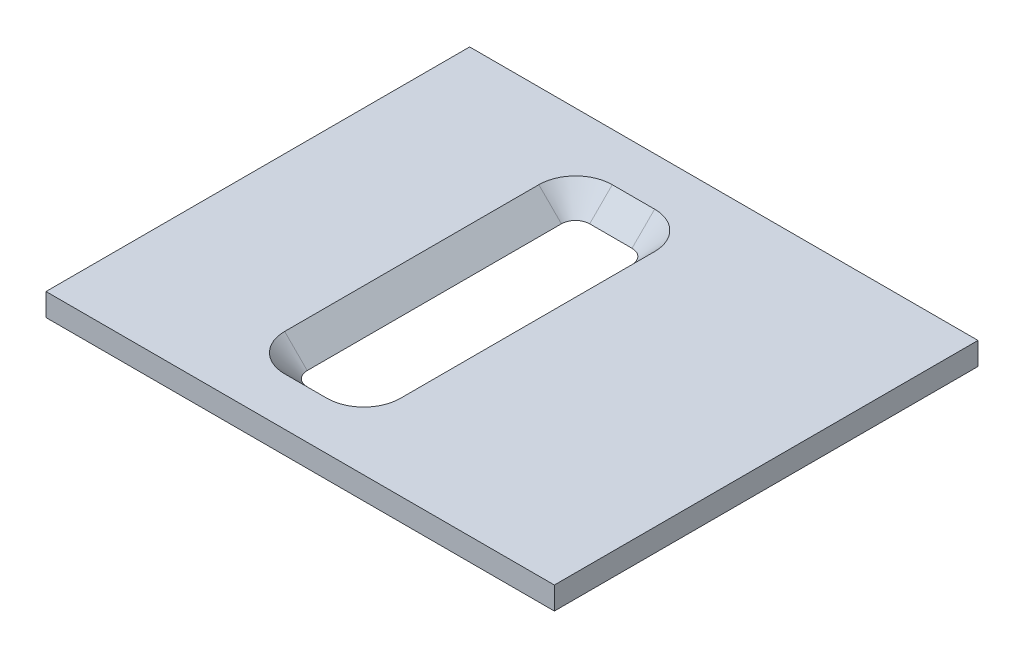
ISO-10303-21;
HEADER;
FILE_DESCRIPTION(('STEP AP214'),'2;1');
FILE_NAME('part.step','',(''),(''),'','','');
FILE_SCHEMA(('AUTOMOTIVE_DESIGN { 1 0 10303 214 1 1 1 1 }'));
ENDSEC;
DATA;
#1=APPLICATION_CONTEXT('core data for automotive mechanical design processes');
#2=APPLICATION_PROTOCOL_DEFINITION('international standard','automotive_design',2000,#1);
#3=PRODUCT_CONTEXT('',#1,'mechanical');
#4=PRODUCT('Part','Part','',(#3));
#5=PRODUCT_RELATED_PRODUCT_CATEGORY('part','',(#4));
#6=PRODUCT_DEFINITION_FORMATION('','',#4);
#7=PRODUCT_DEFINITION_CONTEXT('part definition',#1,'design');
#8=PRODUCT_DEFINITION('design','',#6,#7);
#9=PRODUCT_DEFINITION_SHAPE('','',#8);
#10=(LENGTH_UNIT() NAMED_UNIT(*) SI_UNIT(.MILLI.,.METRE.));
#11=(NAMED_UNIT(*) PLANE_ANGLE_UNIT() SI_UNIT($,.RADIAN.));
#12=(NAMED_UNIT(*) SI_UNIT($,.STERADIAN.) SOLID_ANGLE_UNIT());
#13=UNCERTAINTY_MEASURE_WITH_UNIT(LENGTH_MEASURE(1.E-05),#10,'distance_accuracy_value','');
#14=(GEOMETRIC_REPRESENTATION_CONTEXT(3) GLOBAL_UNCERTAINTY_ASSIGNED_CONTEXT((#13)) GLOBAL_UNIT_ASSIGNED_CONTEXT((#10,
#11,#12)) REPRESENTATION_CONTEXT('',''));
#15=CARTESIAN_POINT('',(0.,0.,0.));
#16=DIRECTION('',(0.,0.,1.));
#17=DIRECTION('',(1.,0.,0.));
#18=AXIS2_PLACEMENT_3D('',#15,#16,#17);
#19=CARTESIAN_POINT('',(0.,1.6002,0.));
#20=DIRECTION('',(0.,1.,0.));
#21=DIRECTION('',(0.,0.,1.));
#22=AXIS2_PLACEMENT_3D('',#19,#20,#21);
#23=PLANE('',#22);
#24=DIRECTION('',(0.,0.,-1.));
#25=VECTOR('',#24,1.);
#26=CARTESIAN_POINT('',(21.,1.6002,-15.));
#27=LINE('',#26,#25);
#28=CARTESIAN_POINT('',(21.,1.6002,15.));
#29=VERTEX_POINT('',#28);
#30=CARTESIAN_POINT('',(21.,1.6002,-15.));
#31=VERTEX_POINT('',#30);
#32=EDGE_CURVE('E187',#29,#31,#27,.T.);
#33=ORIENTED_EDGE('',*,*,#32,.T.);
#34=DIRECTION('',(-1.,0.,0.));
#35=VECTOR('',#34,1.);
#36=CARTESIAN_POINT('',(-15.,1.6002,-15.));
#37=LINE('',#36,#35);
#38=CARTESIAN_POINT('',(-15.,1.6002,-15.));
#39=VERTEX_POINT('',#38);
#40=EDGE_CURVE('E190',#31,#39,#37,.T.);
#41=ORIENTED_EDGE('',*,*,#40,.T.);
#42=DIRECTION('',(0.,0.,1.));
#43=VECTOR('',#42,1.);
#44=CARTESIAN_POINT('',(-15.,1.6002,-15.));
#45=LINE('',#44,#43);
#46=CARTESIAN_POINT('',(-15.,1.6002,15.));
#47=VERTEX_POINT('',#46);
#48=EDGE_CURVE('E193',#39,#47,#45,.T.);
#49=ORIENTED_EDGE('',*,*,#48,.T.);
#50=DIRECTION('',(1.,0.,0.));
#51=VECTOR('',#50,1.);
#52=CARTESIAN_POINT('',(-15.,1.6002,15.));
#53=LINE('',#52,#51);
#54=EDGE_CURVE('E195',#47,#29,#53,.T.);
#55=ORIENTED_EDGE('',*,*,#54,.T.);
#56=EDGE_LOOP('',(#33,#41,#49,#55));
#57=FACE_BOUND('',#56,.T.);
#58=DIRECTION('',(0.,0.,1.));
#59=VECTOR('',#58,1.);
#60=CARTESIAN_POINT('',(4.10020000000001,1.6002,9.));
#61=LINE('',#60,#59);
#62=CARTESIAN_POINT('',(4.10020000000001,1.6002,9.));
#63=VERTEX_POINT('',#62);
#64=CARTESIAN_POINT('',(4.10020000000001,1.6002,-9.));
#65=VERTEX_POINT('',#64);
#66=EDGE_CURVE('E161',#63,#65,#61,.F.);
#67=ORIENTED_EDGE('',*,*,#66,.F.);
#68=CARTESIAN_POINT('',(1.5,1.6002,9.));
#69=DIRECTION('',(0.,1.,0.));
#70=DIRECTION('',(0.,0.,1.));
#71=AXIS2_PLACEMENT_3D('',#68,#69,#70);
#72=CIRCLE('',#71,2.60020000000001);
#73=CARTESIAN_POINT('',(1.5,1.6002,11.6002));
#74=VERTEX_POINT('',#73);
#75=EDGE_CURVE('E138',#74,#63,#72,.T.);
#76=ORIENTED_EDGE('',*,*,#75,.F.);
#77=DIRECTION('',(-1.,0.,0.));
#78=VECTOR('',#77,1.);
#79=CARTESIAN_POINT('',(1.5,1.6002,11.6002));
#80=LINE('',#79,#78);
#81=CARTESIAN_POINT('',(-1.5,1.6002,11.6002));
#82=VERTEX_POINT('',#81);
#83=EDGE_CURVE('E173',#82,#74,#80,.F.);
#84=ORIENTED_EDGE('',*,*,#83,.F.);
#85=CARTESIAN_POINT('',(-1.5,1.6002,9.));
#86=DIRECTION('',(0.,1.,0.));
#87=DIRECTION('',(0.,0.,1.));
#88=AXIS2_PLACEMENT_3D('',#85,#86,#87);
#89=CIRCLE('',#88,2.60020000000001);
#90=CARTESIAN_POINT('',(-4.10020000000001,1.6002,9.));
#91=VERTEX_POINT('',#90);
#92=EDGE_CURVE('E171',#91,#82,#89,.T.);
#93=ORIENTED_EDGE('',*,*,#92,.F.);
#94=DIRECTION('',(0.,0.,-1.));
#95=VECTOR('',#94,1.);
#96=CARTESIAN_POINT('',(-4.10020000000001,1.6002,9.));
#97=LINE('',#96,#95);
#98=CARTESIAN_POINT('',(-4.10020000000001,1.6002,-9.));
#99=VERTEX_POINT('',#98);
#100=EDGE_CURVE('E169',#99,#91,#97,.F.);
#101=ORIENTED_EDGE('',*,*,#100,.F.);
#102=CARTESIAN_POINT('',(-1.5,1.6002,-9.));
#103=DIRECTION('',(0.,1.,0.));
#104=DIRECTION('',(0.,0.,1.));
#105=AXIS2_PLACEMENT_3D('',#102,#103,#104);
#106=CIRCLE('',#105,2.60020000000001);
#107=CARTESIAN_POINT('',(-1.5,1.6002,-11.6002));
#108=VERTEX_POINT('',#107);
#109=EDGE_CURVE('E167',#108,#99,#106,.T.);
#110=ORIENTED_EDGE('',*,*,#109,.F.);
#111=DIRECTION('',(1.,0.,0.));
#112=VECTOR('',#111,1.);
#113=CARTESIAN_POINT('',(1.5,1.6002,-11.6002));
#114=LINE('',#113,#112);
#115=CARTESIAN_POINT('',(1.5,1.6002,-11.6002));
#116=VERTEX_POINT('',#115);
#117=EDGE_CURVE('E165',#116,#108,#114,.F.);
#118=ORIENTED_EDGE('',*,*,#117,.F.);
#119=CARTESIAN_POINT('',(1.5,1.6002,-9.));
#120=DIRECTION('',(0.,1.,0.));
#121=DIRECTION('',(0.,0.,1.));
#122=AXIS2_PLACEMENT_3D('',#119,#120,#121);
#123=CIRCLE('',#122,2.60020000000001);
#124=EDGE_CURVE('E163',#65,#116,#123,.T.);
#125=ORIENTED_EDGE('',*,*,#124,.F.);
#126=EDGE_LOOP('',(#67,#76,#84,#93,#101,#110,#118,#125));
#127=FACE_BOUND('',#126,.T.);
#128=ADVANCED_FACE('F34',(#57,#127),#23,.T.);
#129=CARTESIAN_POINT('',(0.,0.,0.));
#130=DIRECTION('',(0.,1.,0.));
#131=DIRECTION('',(0.,0.,1.));
#132=AXIS2_PLACEMENT_3D('',#129,#130,#131);
#133=PLANE('',#132);
#134=DIRECTION('',(0.,0.,-1.));
#135=VECTOR('',#134,1.);
#136=CARTESIAN_POINT('',(21.,0.,-15.));
#137=LINE('',#136,#135);
#138=CARTESIAN_POINT('',(21.,0.,15.));
#139=VERTEX_POINT('',#138);
#140=CARTESIAN_POINT('',(21.,0.,-15.));
#141=VERTEX_POINT('',#140);
#142=EDGE_CURVE('E139',#139,#141,#137,.T.);
#143=ORIENTED_EDGE('',*,*,#142,.F.);
#144=DIRECTION('',(1.,0.,0.));
#145=VECTOR('',#144,1.);
#146=CARTESIAN_POINT('',(-15.,0.,15.));
#147=LINE('',#146,#145);
#148=CARTESIAN_POINT('',(-15.,0.,15.));
#149=VERTEX_POINT('',#148);
#150=EDGE_CURVE('E191',#149,#139,#147,.T.);
#151=ORIENTED_EDGE('',*,*,#150,.F.);
#152=DIRECTION('',(0.,0.,1.));
#153=VECTOR('',#152,1.);
#154=CARTESIAN_POINT('',(-15.,0.,-15.));
#155=LINE('',#154,#153);
#156=CARTESIAN_POINT('',(-15.,0.,-15.));
#157=VERTEX_POINT('',#156);
#158=EDGE_CURVE('E202',#157,#149,#155,.T.);
#159=ORIENTED_EDGE('',*,*,#158,.F.);
#160=DIRECTION('',(-1.,0.,0.));
#161=VECTOR('',#160,1.);
#162=CARTESIAN_POINT('',(-15.,0.,-15.));
#163=LINE('',#162,#161);
#164=EDGE_CURVE('E200',#141,#157,#163,.T.);
#165=ORIENTED_EDGE('',*,*,#164,.F.);
#166=EDGE_LOOP('',(#143,#151,#159,#165));
#167=FACE_BOUND('',#166,.T.);
#168=CARTESIAN_POINT('',(1.5,0.,9.));
#169=DIRECTION('',(0.,1.,0.));
#170=DIRECTION('',(0.,0.,1.));
#171=AXIS2_PLACEMENT_3D('',#168,#169,#170);
#172=CIRCLE('',#171,1.);
#173=CARTESIAN_POINT('',(1.5,0.,10.));
#174=VERTEX_POINT('',#173);
#175=CARTESIAN_POINT('',(2.5,0.,9.));
#176=VERTEX_POINT('',#175);
#177=EDGE_CURVE('E57',#174,#176,#172,.T.);
#178=ORIENTED_EDGE('',*,*,#177,.T.);
#179=DIRECTION('',(0.,0.,-1.));
#180=VECTOR('',#179,1.);
#181=CARTESIAN_POINT('',(2.5,0.,9.));
#182=LINE('',#181,#180);
#183=CARTESIAN_POINT('',(2.5,0.,-9.));
#184=VERTEX_POINT('',#183);
#185=EDGE_CURVE('E125',#176,#184,#182,.T.);
#186=ORIENTED_EDGE('',*,*,#185,.T.);
#187=CARTESIAN_POINT('',(1.5,0.,-9.));
#188=DIRECTION('',(0.,1.,0.));
#189=DIRECTION('',(0.,0.,1.));
#190=AXIS2_PLACEMENT_3D('',#187,#188,#189);
#191=CIRCLE('',#190,1.);
#192=CARTESIAN_POINT('',(1.5,0.,-10.));
#193=VERTEX_POINT('',#192);
#194=EDGE_CURVE('E134',#184,#193,#191,.T.);
#195=ORIENTED_EDGE('',*,*,#194,.T.);
#196=DIRECTION('',(-1.,0.,0.));
#197=VECTOR('',#196,1.);
#198=CARTESIAN_POINT('',(1.5,0.,-10.));
#199=LINE('',#198,#197);
#200=CARTESIAN_POINT('',(-1.5,0.,-10.));
#201=VERTEX_POINT('',#200);
#202=EDGE_CURVE('E148',#193,#201,#199,.T.);
#203=ORIENTED_EDGE('',*,*,#202,.T.);
#204=CARTESIAN_POINT('',(-1.5,0.,-9.));
#205=DIRECTION('',(0.,1.,0.));
#206=DIRECTION('',(0.,0.,1.));
#207=AXIS2_PLACEMENT_3D('',#204,#205,#206);
#208=CIRCLE('',#207,1.);
#209=CARTESIAN_POINT('',(-2.5,0.,-9.));
#210=VERTEX_POINT('',#209);
#211=EDGE_CURVE('E151',#201,#210,#208,.T.);
#212=ORIENTED_EDGE('',*,*,#211,.T.);
#213=DIRECTION('',(0.,0.,1.));
#214=VECTOR('',#213,1.);
#215=CARTESIAN_POINT('',(-2.5,0.,9.));
#216=LINE('',#215,#214);
#217=CARTESIAN_POINT('',(-2.5,0.,9.));
#218=VERTEX_POINT('',#217);
#219=EDGE_CURVE('E154',#210,#218,#216,.T.);
#220=ORIENTED_EDGE('',*,*,#219,.T.);
#221=CARTESIAN_POINT('',(-1.5,0.,9.));
#222=DIRECTION('',(0.,1.,0.));
#223=DIRECTION('',(0.,0.,-1.));
#224=AXIS2_PLACEMENT_3D('',#221,#222,#223);
#225=CIRCLE('',#224,1.);
#226=CARTESIAN_POINT('',(-1.5,0.,10.));
#227=VERTEX_POINT('',#226);
#228=EDGE_CURVE('E157',#218,#227,#225,.T.);
#229=ORIENTED_EDGE('',*,*,#228,.T.);
#230=DIRECTION('',(1.,0.,0.));
#231=VECTOR('',#230,1.);
#232=CARTESIAN_POINT('',(1.5,0.,10.));
#233=LINE('',#232,#231);
#234=EDGE_CURVE('E144',#227,#174,#233,.T.);
#235=ORIENTED_EDGE('',*,*,#234,.T.);
#236=EDGE_LOOP('',(#178,#186,#195,#203,#212,#220,#229,#235));
#237=FACE_BOUND('',#236,.T.);
#238=ADVANCED_FACE('F142',(#167,#237),#133,.F.);
#239=CARTESIAN_POINT('',(21.,1.6002,-15.));
#240=DIRECTION('',(-1.,0.,0.));
#241=DIRECTION('',(0.,0.,1.));
#242=AXIS2_PLACEMENT_3D('',#239,#240,#241);
#243=PLANE('',#242);
#244=ORIENTED_EDGE('',*,*,#142,.T.);
#245=DIRECTION('',(0.,-1.,0.));
#246=VECTOR('',#245,1.);
#247=CARTESIAN_POINT('',(21.,1.6002,-15.));
#248=LINE('',#247,#246);
#249=EDGE_CURVE('E11',#31,#141,#248,.T.);
#250=ORIENTED_EDGE('',*,*,#249,.F.);
#251=ORIENTED_EDGE('',*,*,#32,.F.);
#252=DIRECTION('',(0.,-1.,0.));
#253=VECTOR('',#252,1.);
#254=CARTESIAN_POINT('',(21.,1.6002,15.));
#255=LINE('',#254,#253);
#256=EDGE_CURVE('E197',#29,#139,#255,.T.);
#257=ORIENTED_EDGE('',*,*,#256,.T.);
#258=EDGE_LOOP('',(#244,#250,#251,#257));
#259=FACE_BOUND('',#258,.T.);
#260=ADVANCED_FACE('F36',(#259),#243,.F.);
#261=CARTESIAN_POINT('',(-15.,1.6002,-15.));
#262=DIRECTION('',(0.,0.,1.));
#263=DIRECTION('',(1.,0.,0.));
#264=AXIS2_PLACEMENT_3D('',#261,#262,#263);
#265=PLANE('',#264);
#266=ORIENTED_EDGE('',*,*,#164,.T.);
#267=DIRECTION('',(0.,-1.,0.));
#268=VECTOR('',#267,1.);
#269=CARTESIAN_POINT('',(-15.,1.6002,-15.));
#270=LINE('',#269,#268);
#271=EDGE_CURVE('E42',#39,#157,#270,.T.);
#272=ORIENTED_EDGE('',*,*,#271,.F.);
#273=ORIENTED_EDGE('',*,*,#40,.F.);
#274=ORIENTED_EDGE('',*,*,#249,.T.);
#275=EDGE_LOOP('',(#266,#272,#273,#274));
#276=FACE_BOUND('',#275,.T.);
#277=ADVANCED_FACE('F229',(#276),#265,.F.);
#278=CARTESIAN_POINT('',(-15.,1.6002,-15.));
#279=DIRECTION('',(1.,0.,0.));
#280=DIRECTION('',(0.,0.,-1.));
#281=AXIS2_PLACEMENT_3D('',#278,#279,#280);
#282=PLANE('',#281);
#283=ORIENTED_EDGE('',*,*,#158,.T.);
#284=DIRECTION('',(0.,-1.,0.));
#285=VECTOR('',#284,1.);
#286=CARTESIAN_POINT('',(-15.,1.6002,15.));
#287=LINE('',#286,#285);
#288=EDGE_CURVE('E207',#47,#149,#287,.T.);
#289=ORIENTED_EDGE('',*,*,#288,.F.);
#290=ORIENTED_EDGE('',*,*,#48,.F.);
#291=ORIENTED_EDGE('',*,*,#271,.T.);
#292=EDGE_LOOP('',(#283,#289,#290,#291));
#293=FACE_BOUND('',#292,.T.);
#294=ADVANCED_FACE('F214',(#293),#282,.F.);
#295=CARTESIAN_POINT('',(-15.,1.6002,15.));
#296=DIRECTION('',(0.,0.,-1.));
#297=DIRECTION('',(-1.,0.,0.));
#298=AXIS2_PLACEMENT_3D('',#295,#296,#297);
#299=PLANE('',#298);
#300=ORIENTED_EDGE('',*,*,#150,.T.);
#301=ORIENTED_EDGE('',*,*,#256,.F.);
#302=ORIENTED_EDGE('',*,*,#54,.F.);
#303=ORIENTED_EDGE('',*,*,#288,.T.);
#304=EDGE_LOOP('',(#300,#301,#302,#303));
#305=FACE_BOUND('',#304,.T.);
#306=ADVANCED_FACE('F222',(#305),#299,.F.);
#307=CARTESIAN_POINT('',(1.5,0.,9.));
#308=DIRECTION('',(0.,1.,0.));
#309=DIRECTION('',(0.,0.,1.));
#310=AXIS2_PLACEMENT_3D('',#307,#308,#309);
#311=CONICAL_SURFACE('',#310,1.,0.78539816339745);
#312=ORIENTED_EDGE('',*,*,#177,.F.);
#313=DIRECTION('',(0.,0.707106781186546,0.707106781186549));
#314=VECTOR('',#313,1.);
#315=CARTESIAN_POINT('',(1.5,0.,10.));
#316=LINE('',#315,#314);
#317=EDGE_CURVE('E174',#74,#174,#316,.F.);
#318=ORIENTED_EDGE('',*,*,#317,.F.);
#319=ORIENTED_EDGE('',*,*,#75,.T.);
#320=DIRECTION('',(0.707106781186549,0.707106781186546,0.));
#321=VECTOR('',#320,1.);
#322=CARTESIAN_POINT('',(2.5,0.,9.));
#323=LINE('',#322,#321);
#324=EDGE_CURVE('E127',#63,#176,#323,.F.);
#325=ORIENTED_EDGE('',*,*,#324,.T.);
#326=EDGE_LOOP('',(#312,#318,#319,#325));
#327=FACE_BOUND('',#326,.T.);
#328=ADVANCED_FACE('F136',(#327),#311,.F.);
#329=CARTESIAN_POINT('',(2.5,0.,9.));
#330=DIRECTION('',(0.707106781186546,-0.707106781186549,0.));
#331=DIRECTION('',(0.707106781186549,0.707106781186546,0.));
#332=AXIS2_PLACEMENT_3D('',#329,#330,#331);
#333=PLANE('',#332);
#334=ORIENTED_EDGE('',*,*,#185,.F.);
#335=ORIENTED_EDGE('',*,*,#324,.F.);
#336=ORIENTED_EDGE('',*,*,#66,.T.);
#337=DIRECTION('',(0.707106781186549,0.707106781186546,0.));
#338=VECTOR('',#337,1.);
#339=CARTESIAN_POINT('',(2.5,0.,-9.));
#340=LINE('',#339,#338);
#341=EDGE_CURVE('E130',#65,#184,#340,.F.);
#342=ORIENTED_EDGE('',*,*,#341,.T.);
#343=EDGE_LOOP('',(#334,#335,#336,#342));
#344=FACE_BOUND('',#343,.T.);
#345=ADVANCED_FACE('F126',(#344),#333,.F.);
#346=CARTESIAN_POINT('',(1.5,0.,-9.));
#347=DIRECTION('',(0.,1.,0.));
#348=DIRECTION('',(0.,0.,1.));
#349=AXIS2_PLACEMENT_3D('',#346,#347,#348);
#350=CONICAL_SURFACE('',#349,1.,0.78539816339745);
#351=ORIENTED_EDGE('',*,*,#194,.F.);
#352=ORIENTED_EDGE('',*,*,#341,.F.);
#353=ORIENTED_EDGE('',*,*,#124,.T.);
#354=DIRECTION('',(0.,0.707106781186546,-0.707106781186549));
#355=VECTOR('',#354,1.);
#356=CARTESIAN_POINT('',(1.5,0.,-10.));
#357=LINE('',#356,#355);
#358=EDGE_CURVE('E184',#116,#193,#357,.F.);
#359=ORIENTED_EDGE('',*,*,#358,.T.);
#360=EDGE_LOOP('',(#351,#352,#353,#359));
#361=FACE_BOUND('',#360,.T.);
#362=ADVANCED_FACE('F253',(#361),#350,.F.);
#363=CARTESIAN_POINT('',(1.5,0.,-10.));
#364=DIRECTION('',(0.,-0.707106781186549,-0.707106781186546));
#365=DIRECTION('',(0.,0.707106781186546,-0.707106781186549));
#366=AXIS2_PLACEMENT_3D('',#363,#364,#365);
#367=PLANE('',#366);
#368=ORIENTED_EDGE('',*,*,#202,.F.);
#369=ORIENTED_EDGE('',*,*,#358,.F.);
#370=ORIENTED_EDGE('',*,*,#117,.T.);
#371=DIRECTION('',(0.,0.707106781186546,-0.707106781186549));
#372=VECTOR('',#371,1.);
#373=CARTESIAN_POINT('',(-1.5,0.,-10.));
#374=LINE('',#373,#372);
#375=EDGE_CURVE('E182',#108,#201,#374,.F.);
#376=ORIENTED_EDGE('',*,*,#375,.T.);
#377=EDGE_LOOP('',(#368,#369,#370,#376));
#378=FACE_BOUND('',#377,.T.);
#379=ADVANCED_FACE('F269',(#378),#367,.F.);
#380=CARTESIAN_POINT('',(-1.5,0.,-9.));
#381=DIRECTION('',(0.,1.,0.));
#382=DIRECTION('',(0.,0.,1.));
#383=AXIS2_PLACEMENT_3D('',#380,#381,#382);
#384=CONICAL_SURFACE('',#383,1.,0.78539816339745);
#385=ORIENTED_EDGE('',*,*,#211,.F.);
#386=ORIENTED_EDGE('',*,*,#375,.F.);
#387=ORIENTED_EDGE('',*,*,#109,.T.);
#388=DIRECTION('',(-0.707106781186549,0.707106781186546,0.));
#389=VECTOR('',#388,1.);
#390=CARTESIAN_POINT('',(-2.5,0.,-9.));
#391=LINE('',#390,#389);
#392=EDGE_CURVE('E180',#99,#210,#391,.F.);
#393=ORIENTED_EDGE('',*,*,#392,.T.);
#394=EDGE_LOOP('',(#385,#386,#387,#393));
#395=FACE_BOUND('',#394,.T.);
#396=ADVANCED_FACE('F265',(#395),#384,.F.);
#397=CARTESIAN_POINT('',(-2.5,0.,9.));
#398=DIRECTION('',(-0.707106781186546,-0.707106781186549,0.));
#399=DIRECTION('',(0.707106781186549,-0.707106781186546,0.));
#400=AXIS2_PLACEMENT_3D('',#397,#398,#399);
#401=PLANE('',#400);
#402=ORIENTED_EDGE('',*,*,#219,.F.);
#403=ORIENTED_EDGE('',*,*,#392,.F.);
#404=ORIENTED_EDGE('',*,*,#100,.T.);
#405=DIRECTION('',(-0.707106781186549,0.707106781186546,0.));
#406=VECTOR('',#405,1.);
#407=CARTESIAN_POINT('',(-2.5,0.,9.));
#408=LINE('',#407,#406);
#409=EDGE_CURVE('E178',#91,#218,#408,.F.);
#410=ORIENTED_EDGE('',*,*,#409,.T.);
#411=EDGE_LOOP('',(#402,#403,#404,#410));
#412=FACE_BOUND('',#411,.T.);
#413=ADVANCED_FACE('F261',(#412),#401,.F.);
#414=CARTESIAN_POINT('',(-1.5,0.,9.));
#415=DIRECTION('',(0.,1.,0.));
#416=DIRECTION('',(0.,0.,-1.));
#417=AXIS2_PLACEMENT_3D('',#414,#415,#416);
#418=CONICAL_SURFACE('',#417,1.,0.78539816339745);
#419=ORIENTED_EDGE('',*,*,#228,.F.);
#420=ORIENTED_EDGE('',*,*,#409,.F.);
#421=ORIENTED_EDGE('',*,*,#92,.T.);
#422=DIRECTION('',(0.,0.707106781186546,0.707106781186549));
#423=VECTOR('',#422,1.);
#424=CARTESIAN_POINT('',(-1.5,0.,10.));
#425=LINE('',#424,#423);
#426=EDGE_CURVE('E49',#82,#227,#425,.F.);
#427=ORIENTED_EDGE('',*,*,#426,.T.);
#428=EDGE_LOOP('',(#419,#420,#421,#427));
#429=FACE_BOUND('',#428,.T.);
#430=ADVANCED_FACE('F258',(#429),#418,.F.);
#431=CARTESIAN_POINT('',(1.5,0.,10.));
#432=DIRECTION('',(0.,-0.707106781186549,0.707106781186546));
#433=DIRECTION('',(0.,-0.707106781186546,-0.707106781186549));
#434=AXIS2_PLACEMENT_3D('',#431,#432,#433);
#435=PLANE('',#434);
#436=ORIENTED_EDGE('',*,*,#234,.F.);
#437=ORIENTED_EDGE('',*,*,#426,.F.);
#438=ORIENTED_EDGE('',*,*,#83,.T.);
#439=ORIENTED_EDGE('',*,*,#317,.T.);
#440=EDGE_LOOP('',(#436,#437,#438,#439));
#441=FACE_BOUND('',#440,.T.);
#442=ADVANCED_FACE('F255',(#441),#435,.F.);
#443=CLOSED_SHELL('',(#128,#238,#260,#277,#294,#306,#328,#345,#362,#379,#396,#413,#430,#442));
#444=MANIFOLD_SOLID_BREP('B2',#443);
#445=ADVANCED_BREP_SHAPE_REPRESENTATION('',(#18,#444),#14);
#446=SHAPE_DEFINITION_REPRESENTATION(#9,#445);
ENDSEC;
END-ISO-10303-21;
